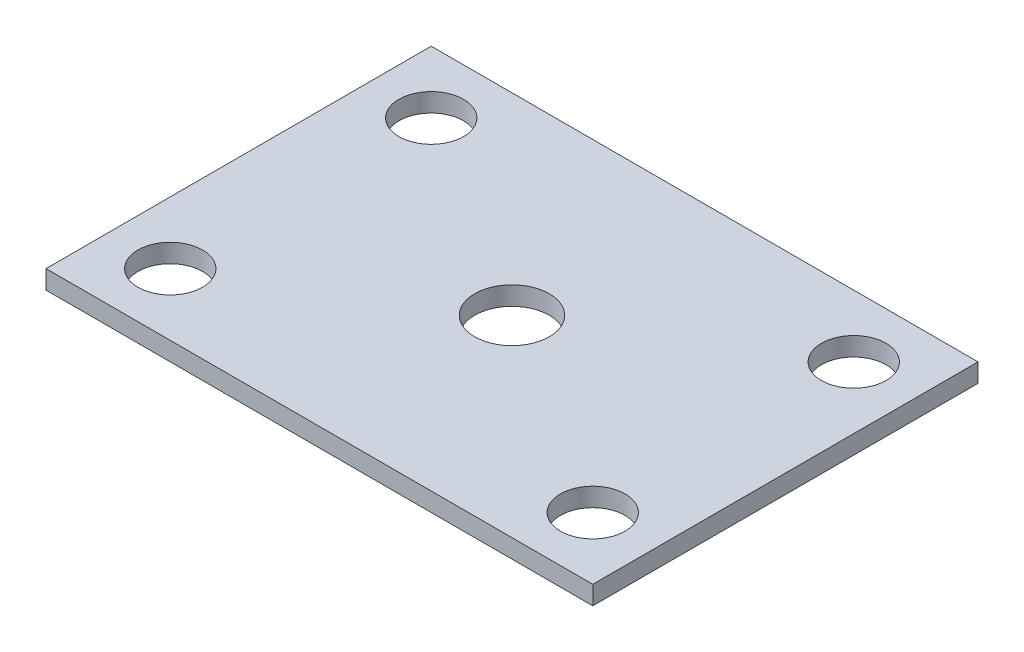
ISO-10303-21;
HEADER;
FILE_DESCRIPTION(('STEP AP214'),'2;1');
FILE_NAME('part.step','',(''),(''),'','','');
FILE_SCHEMA(('AUTOMOTIVE_DESIGN { 1 0 10303 214 1 1 1 1 }'));
ENDSEC;
DATA;
#1=APPLICATION_CONTEXT('core data for automotive mechanical design processes');
#2=APPLICATION_PROTOCOL_DEFINITION('international standard','automotive_design',2000,#1);
#3=PRODUCT_CONTEXT('',#1,'mechanical');
#4=PRODUCT('Part','Part','',(#3));
#5=PRODUCT_RELATED_PRODUCT_CATEGORY('part','',(#4));
#6=PRODUCT_DEFINITION_FORMATION('','',#4);
#7=PRODUCT_DEFINITION_CONTEXT('part definition',#1,'design');
#8=PRODUCT_DEFINITION('design','',#6,#7);
#9=PRODUCT_DEFINITION_SHAPE('','',#8);
#10=(LENGTH_UNIT() NAMED_UNIT(*) SI_UNIT(.MILLI.,.METRE.));
#11=(NAMED_UNIT(*) PLANE_ANGLE_UNIT() SI_UNIT($,.RADIAN.));
#12=(NAMED_UNIT(*) SI_UNIT($,.STERADIAN.) SOLID_ANGLE_UNIT());
#13=UNCERTAINTY_MEASURE_WITH_UNIT(LENGTH_MEASURE(1.E-05),#10,'distance_accuracy_value','');
#14=(GEOMETRIC_REPRESENTATION_CONTEXT(3) GLOBAL_UNCERTAINTY_ASSIGNED_CONTEXT((#13)) GLOBAL_UNIT_ASSIGNED_CONTEXT((#10,
#11,#12)) REPRESENTATION_CONTEXT('',''));
#15=CARTESIAN_POINT('',(0.,0.,0.));
#16=DIRECTION('',(0.,0.,1.));
#17=DIRECTION('',(1.,0.,0.));
#18=AXIS2_PLACEMENT_3D('',#15,#16,#17);
#19=CARTESIAN_POINT('',(-22.,1.5,15.5));
#20=DIRECTION('',(1.,0.,0.));
#21=DIRECTION('',(0.,0.,-1.));
#22=AXIS2_PLACEMENT_3D('',#19,#20,#21);
#23=PLANE('',#22);
#24=DIRECTION('',(0.,0.,1.));
#25=VECTOR('',#24,1.);
#26=CARTESIAN_POINT('',(-22.,0.,15.5));
#27=LINE('',#26,#25);
#28=CARTESIAN_POINT('',(-22.,0.,-15.5));
#29=VERTEX_POINT('',#28);
#30=CARTESIAN_POINT('',(-22.,0.,15.5));
#31=VERTEX_POINT('',#30);
#32=EDGE_CURVE('E96',#29,#31,#27,.T.);
#33=ORIENTED_EDGE('',*,*,#32,.T.);
#34=DIRECTION('',(0.,-1.,0.));
#35=VECTOR('',#34,1.);
#36=CARTESIAN_POINT('',(-22.,1.5,15.5));
#37=LINE('',#36,#35);
#38=CARTESIAN_POINT('',(-22.,1.5,15.5));
#39=VERTEX_POINT('',#38);
#40=EDGE_CURVE('E11',#39,#31,#37,.T.);
#41=ORIENTED_EDGE('',*,*,#40,.F.);
#42=DIRECTION('',(0.,0.,1.));
#43=VECTOR('',#42,1.);
#44=CARTESIAN_POINT('',(-22.,1.5,15.5));
#45=LINE('',#44,#43);
#46=CARTESIAN_POINT('',(-22.,1.5,-15.5));
#47=VERTEX_POINT('',#46);
#48=EDGE_CURVE('E84',#47,#39,#45,.T.);
#49=ORIENTED_EDGE('',*,*,#48,.F.);
#50=DIRECTION('',(0.,-1.,0.));
#51=VECTOR('',#50,1.);
#52=CARTESIAN_POINT('',(-22.,1.5,-15.5));
#53=LINE('',#52,#51);
#54=EDGE_CURVE('E92',#47,#29,#53,.T.);
#55=ORIENTED_EDGE('',*,*,#54,.T.);
#56=EDGE_LOOP('',(#33,#41,#49,#55));
#57=FACE_BOUND('',#56,.T.);
#58=ADVANCED_FACE('F33',(#57),#23,.F.);
#59=CARTESIAN_POINT('',(22.,1.5,15.5));
#60=DIRECTION('',(0.,0.,-1.));
#61=DIRECTION('',(-1.,0.,0.));
#62=AXIS2_PLACEMENT_3D('',#59,#60,#61);
#63=PLANE('',#62);
#64=DIRECTION('',(1.,0.,0.));
#65=VECTOR('',#64,1.);
#66=CARTESIAN_POINT('',(22.,0.,15.5));
#67=LINE('',#66,#65);
#68=CARTESIAN_POINT('',(22.,0.,15.5));
#69=VERTEX_POINT('',#68);
#70=EDGE_CURVE('E88',#31,#69,#67,.T.);
#71=ORIENTED_EDGE('',*,*,#70,.T.);
#72=DIRECTION('',(0.,-1.,0.));
#73=VECTOR('',#72,1.);
#74=CARTESIAN_POINT('',(22.,1.5,15.5));
#75=LINE('',#74,#73);
#76=CARTESIAN_POINT('',(22.,1.5,15.5));
#77=VERTEX_POINT('',#76);
#78=EDGE_CURVE('E41',#77,#69,#75,.T.);
#79=ORIENTED_EDGE('',*,*,#78,.F.);
#80=DIRECTION('',(1.,0.,0.));
#81=VECTOR('',#80,1.);
#82=CARTESIAN_POINT('',(22.,1.5,15.5));
#83=LINE('',#82,#81);
#84=EDGE_CURVE('E79',#39,#77,#83,.T.);
#85=ORIENTED_EDGE('',*,*,#84,.F.);
#86=ORIENTED_EDGE('',*,*,#40,.T.);
#87=EDGE_LOOP('',(#71,#79,#85,#86));
#88=FACE_BOUND('',#87,.T.);
#89=ADVANCED_FACE('F87',(#88),#63,.F.);
#90=CARTESIAN_POINT('',(22.,1.5,15.5));
#91=DIRECTION('',(-1.,0.,0.));
#92=DIRECTION('',(0.,0.,1.));
#93=AXIS2_PLACEMENT_3D('',#90,#91,#92);
#94=PLANE('',#93);
#95=DIRECTION('',(0.,0.,-1.));
#96=VECTOR('',#95,1.);
#97=CARTESIAN_POINT('',(22.,0.,15.5));
#98=LINE('',#97,#96);
#99=CARTESIAN_POINT('',(22.,0.,-15.5));
#100=VERTEX_POINT('',#99);
#101=EDGE_CURVE('E66',#69,#100,#98,.T.);
#102=ORIENTED_EDGE('',*,*,#101,.T.);
#103=DIRECTION('',(0.,-1.,0.));
#104=VECTOR('',#103,1.);
#105=CARTESIAN_POINT('',(22.,1.5,-15.5));
#106=LINE('',#105,#104);
#107=CARTESIAN_POINT('',(22.,1.5,-15.5));
#108=VERTEX_POINT('',#107);
#109=EDGE_CURVE('E89',#108,#100,#106,.T.);
#110=ORIENTED_EDGE('',*,*,#109,.F.);
#111=DIRECTION('',(0.,0.,-1.));
#112=VECTOR('',#111,1.);
#113=CARTESIAN_POINT('',(22.,1.5,15.5));
#114=LINE('',#113,#112);
#115=EDGE_CURVE('E82',#77,#108,#114,.T.);
#116=ORIENTED_EDGE('',*,*,#115,.F.);
#117=ORIENTED_EDGE('',*,*,#78,.T.);
#118=EDGE_LOOP('',(#102,#110,#116,#117));
#119=FACE_BOUND('',#118,.T.);
#120=ADVANCED_FACE('F90',(#119),#94,.F.);
#121=CARTESIAN_POINT('',(22.,1.5,-15.5));
#122=DIRECTION('',(0.,0.,1.));
#123=DIRECTION('',(1.,0.,0.));
#124=AXIS2_PLACEMENT_3D('',#121,#122,#123);
#125=PLANE('',#124);
#126=DIRECTION('',(-1.,0.,0.));
#127=VECTOR('',#126,1.);
#128=CARTESIAN_POINT('',(22.,0.,-15.5));
#129=LINE('',#128,#127);
#130=EDGE_CURVE('E72',#100,#29,#129,.T.);
#131=ORIENTED_EDGE('',*,*,#130,.T.);
#132=ORIENTED_EDGE('',*,*,#54,.F.);
#133=DIRECTION('',(-1.,0.,0.));
#134=VECTOR('',#133,1.);
#135=CARTESIAN_POINT('',(22.,1.5,-15.5));
#136=LINE('',#135,#134);
#137=EDGE_CURVE('E49',#108,#47,#136,.T.);
#138=ORIENTED_EDGE('',*,*,#137,.F.);
#139=ORIENTED_EDGE('',*,*,#109,.T.);
#140=EDGE_LOOP('',(#131,#132,#138,#139));
#141=FACE_BOUND('',#140,.T.);
#142=ADVANCED_FACE('F104',(#141),#125,.F.);
#143=CARTESIAN_POINT('',(0.,1.5,0.));
#144=DIRECTION('',(0.,1.,0.));
#145=DIRECTION('',(0.,0.,1.));
#146=AXIS2_PLACEMENT_3D('',#143,#144,#145);
#147=PLANE('',#146);
#148=CARTESIAN_POINT('',(0.,1.5,0.));
#149=DIRECTION('',(0.,1.,0.));
#150=DIRECTION('',(0.,0.,1.));
#151=AXIS2_PLACEMENT_3D('',#148,#149,#150);
#152=CIRCLE('',#151,3.);
#153=CARTESIAN_POINT('',(0.,1.5,3.));
#154=VERTEX_POINT('',#153);
#155=EDGE_CURVE('E134',#154,#154,#152,.T.);
#156=ORIENTED_EDGE('',*,*,#155,.F.);
#157=EDGE_LOOP('',(#156));
#158=FACE_BOUND('',#157,.T.);
#159=CARTESIAN_POINT('',(-17.,1.5,10.5));
#160=DIRECTION('',(0.,1.,0.));
#161=DIRECTION('',(0.,0.,-1.));
#162=AXIS2_PLACEMENT_3D('',#159,#160,#161);
#163=CIRCLE('',#162,2.6);
#164=CARTESIAN_POINT('',(-17.,1.5,7.9));
#165=VERTEX_POINT('',#164);
#166=EDGE_CURVE('E128',#165,#165,#163,.T.);
#167=ORIENTED_EDGE('',*,*,#166,.F.);
#168=EDGE_LOOP('',(#167));
#169=FACE_BOUND('',#168,.T.);
#170=CARTESIAN_POINT('',(17.,1.5,10.5));
#171=DIRECTION('',(0.,1.,0.));
#172=DIRECTION('',(0.,0.,1.));
#173=AXIS2_PLACEMENT_3D('',#170,#171,#172);
#174=CIRCLE('',#173,2.6);
#175=CARTESIAN_POINT('',(17.,1.5,13.1));
#176=VERTEX_POINT('',#175);
#177=EDGE_CURVE('E122',#176,#176,#174,.T.);
#178=ORIENTED_EDGE('',*,*,#177,.F.);
#179=EDGE_LOOP('',(#178));
#180=FACE_BOUND('',#179,.T.);
#181=CARTESIAN_POINT('',(17.,1.5,-10.5));
#182=DIRECTION('',(0.,1.,0.));
#183=DIRECTION('',(0.,0.,-1.));
#184=AXIS2_PLACEMENT_3D('',#181,#182,#183);
#185=CIRCLE('',#184,2.6);
#186=CARTESIAN_POINT('',(17.,1.5,-13.1));
#187=VERTEX_POINT('',#186);
#188=EDGE_CURVE('E116',#187,#187,#185,.T.);
#189=ORIENTED_EDGE('',*,*,#188,.F.);
#190=EDGE_LOOP('',(#189));
#191=FACE_BOUND('',#190,.T.);
#192=CARTESIAN_POINT('',(-17.,1.5,-10.5));
#193=DIRECTION('',(0.,1.,0.));
#194=DIRECTION('',(0.,0.,1.));
#195=AXIS2_PLACEMENT_3D('',#192,#193,#194);
#196=CIRCLE('',#195,2.6);
#197=CARTESIAN_POINT('',(-17.,1.5,-7.9));
#198=VERTEX_POINT('',#197);
#199=EDGE_CURVE('E110',#198,#198,#196,.T.);
#200=ORIENTED_EDGE('',*,*,#199,.F.);
#201=EDGE_LOOP('',(#200));
#202=FACE_BOUND('',#201,.T.);
#203=ORIENTED_EDGE('',*,*,#48,.T.);
#204=ORIENTED_EDGE('',*,*,#84,.T.);
#205=ORIENTED_EDGE('',*,*,#115,.T.);
#206=ORIENTED_EDGE('',*,*,#137,.T.);
#207=EDGE_LOOP('',(#203,#204,#205,#206));
#208=FACE_BOUND('',#207,.T.);
#209=ADVANCED_FACE('F80',(#158,#169,#180,#191,#202,#208),#147,.T.);
#210=CARTESIAN_POINT('',(0.,0.,0.));
#211=DIRECTION('',(0.,1.,0.));
#212=DIRECTION('',(0.,0.,1.));
#213=AXIS2_PLACEMENT_3D('',#210,#211,#212);
#214=PLANE('',#213);
#215=CARTESIAN_POINT('',(0.,0.,0.));
#216=DIRECTION('',(0.,1.,0.));
#217=DIRECTION('',(0.,0.,1.));
#218=AXIS2_PLACEMENT_3D('',#215,#216,#217);
#219=CIRCLE('',#218,3.);
#220=CARTESIAN_POINT('',(0.,0.,3.));
#221=VERTEX_POINT('',#220);
#222=EDGE_CURVE('E131',#221,#221,#219,.T.);
#223=ORIENTED_EDGE('',*,*,#222,.T.);
#224=EDGE_LOOP('',(#223));
#225=FACE_BOUND('',#224,.T.);
#226=CARTESIAN_POINT('',(-17.,0.,10.5));
#227=DIRECTION('',(0.,1.,0.));
#228=DIRECTION('',(0.,0.,-1.));
#229=AXIS2_PLACEMENT_3D('',#226,#227,#228);
#230=CIRCLE('',#229,2.6);
#231=CARTESIAN_POINT('',(-17.,0.,7.9));
#232=VERTEX_POINT('',#231);
#233=EDGE_CURVE('E125',#232,#232,#230,.T.);
#234=ORIENTED_EDGE('',*,*,#233,.T.);
#235=EDGE_LOOP('',(#234));
#236=FACE_BOUND('',#235,.T.);
#237=CARTESIAN_POINT('',(17.,0.,10.5));
#238=DIRECTION('',(0.,1.,0.));
#239=DIRECTION('',(0.,0.,1.));
#240=AXIS2_PLACEMENT_3D('',#237,#238,#239);
#241=CIRCLE('',#240,2.6);
#242=CARTESIAN_POINT('',(17.,0.,13.1));
#243=VERTEX_POINT('',#242);
#244=EDGE_CURVE('E119',#243,#243,#241,.T.);
#245=ORIENTED_EDGE('',*,*,#244,.T.);
#246=EDGE_LOOP('',(#245));
#247=FACE_BOUND('',#246,.T.);
#248=CARTESIAN_POINT('',(17.,0.,-10.5));
#249=DIRECTION('',(0.,1.,0.));
#250=DIRECTION('',(0.,0.,-1.));
#251=AXIS2_PLACEMENT_3D('',#248,#249,#250);
#252=CIRCLE('',#251,2.6);
#253=CARTESIAN_POINT('',(17.,0.,-13.1));
#254=VERTEX_POINT('',#253);
#255=EDGE_CURVE('E113',#254,#254,#252,.T.);
#256=ORIENTED_EDGE('',*,*,#255,.T.);
#257=EDGE_LOOP('',(#256));
#258=FACE_BOUND('',#257,.T.);
#259=CARTESIAN_POINT('',(-17.,0.,-10.5));
#260=DIRECTION('',(0.,1.,0.));
#261=DIRECTION('',(0.,0.,1.));
#262=AXIS2_PLACEMENT_3D('',#259,#260,#261);
#263=CIRCLE('',#262,2.6);
#264=CARTESIAN_POINT('',(-17.,0.,-7.9));
#265=VERTEX_POINT('',#264);
#266=EDGE_CURVE('E99',#265,#265,#263,.T.);
#267=ORIENTED_EDGE('',*,*,#266,.T.);
#268=EDGE_LOOP('',(#267));
#269=FACE_BOUND('',#268,.T.);
#270=ORIENTED_EDGE('',*,*,#32,.F.);
#271=ORIENTED_EDGE('',*,*,#130,.F.);
#272=ORIENTED_EDGE('',*,*,#101,.F.);
#273=ORIENTED_EDGE('',*,*,#70,.F.);
#274=EDGE_LOOP('',(#270,#271,#272,#273));
#275=FACE_BOUND('',#274,.T.);
#276=ADVANCED_FACE('F107',(#225,#236,#247,#258,#269,#275),#214,.F.);
#277=CARTESIAN_POINT('',(-17.,0.,-10.5));
#278=DIRECTION('',(0.,1.,0.));
#279=DIRECTION('',(0.,0.,1.));
#280=AXIS2_PLACEMENT_3D('',#277,#278,#279);
#281=CYLINDRICAL_SURFACE('',#280,2.6);
#282=ORIENTED_EDGE('',*,*,#266,.F.);
#283=EDGE_LOOP('',(#282));
#284=FACE_BOUND('',#283,.T.);
#285=ORIENTED_EDGE('',*,*,#199,.T.);
#286=EDGE_LOOP('',(#285));
#287=FACE_BOUND('',#286,.T.);
#288=ADVANCED_FACE('F160',(#284,#287),#281,.F.);
#289=CARTESIAN_POINT('',(17.,0.,-10.5));
#290=DIRECTION('',(0.,1.,0.));
#291=DIRECTION('',(0.,0.,1.));
#292=AXIS2_PLACEMENT_3D('',#289,#290,#291);
#293=CYLINDRICAL_SURFACE('',#292,2.6);
#294=ORIENTED_EDGE('',*,*,#255,.F.);
#295=EDGE_LOOP('',(#294));
#296=FACE_BOUND('',#295,.T.);
#297=ORIENTED_EDGE('',*,*,#188,.T.);
#298=EDGE_LOOP('',(#297));
#299=FACE_BOUND('',#298,.T.);
#300=ADVANCED_FACE('F162',(#296,#299),#293,.F.);
#301=CARTESIAN_POINT('',(17.,0.,10.5));
#302=DIRECTION('',(0.,1.,0.));
#303=DIRECTION('',(0.,0.,1.));
#304=AXIS2_PLACEMENT_3D('',#301,#302,#303);
#305=CYLINDRICAL_SURFACE('',#304,2.6);
#306=ORIENTED_EDGE('',*,*,#244,.F.);
#307=EDGE_LOOP('',(#306));
#308=FACE_BOUND('',#307,.T.);
#309=ORIENTED_EDGE('',*,*,#177,.T.);
#310=EDGE_LOOP('',(#309));
#311=FACE_BOUND('',#310,.T.);
#312=ADVANCED_FACE('F169',(#308,#311),#305,.F.);
#313=CARTESIAN_POINT('',(-17.,0.,10.5));
#314=DIRECTION('',(0.,1.,0.));
#315=DIRECTION('',(0.,0.,1.));
#316=AXIS2_PLACEMENT_3D('',#313,#314,#315);
#317=CYLINDRICAL_SURFACE('',#316,2.6);
#318=ORIENTED_EDGE('',*,*,#233,.F.);
#319=EDGE_LOOP('',(#318));
#320=FACE_BOUND('',#319,.T.);
#321=ORIENTED_EDGE('',*,*,#166,.T.);
#322=EDGE_LOOP('',(#321));
#323=FACE_BOUND('',#322,.T.);
#324=ADVANCED_FACE('F145',(#320,#323),#317,.F.);
#325=CARTESIAN_POINT('',(0.,0.,0.));
#326=DIRECTION('',(0.,1.,0.));
#327=DIRECTION('',(0.,0.,1.));
#328=AXIS2_PLACEMENT_3D('',#325,#326,#327);
#329=CYLINDRICAL_SURFACE('',#328,3.);
#330=ORIENTED_EDGE('',*,*,#222,.F.);
#331=EDGE_LOOP('',(#330));
#332=FACE_BOUND('',#331,.T.);
#333=ORIENTED_EDGE('',*,*,#155,.T.);
#334=EDGE_LOOP('',(#333));
#335=FACE_BOUND('',#334,.T.);
#336=ADVANCED_FACE('F142',(#332,#335),#329,.F.);
#337=CLOSED_SHELL('',(#58,#89,#120,#142,#209,#276,#288,#300,#312,#324,#336));
#338=MANIFOLD_SOLID_BREP('B2',#337);
#339=ADVANCED_BREP_SHAPE_REPRESENTATION('',(#18,#338),#14);
#340=SHAPE_DEFINITION_REPRESENTATION(#9,#339);
ENDSEC;
END-ISO-10303-21;
